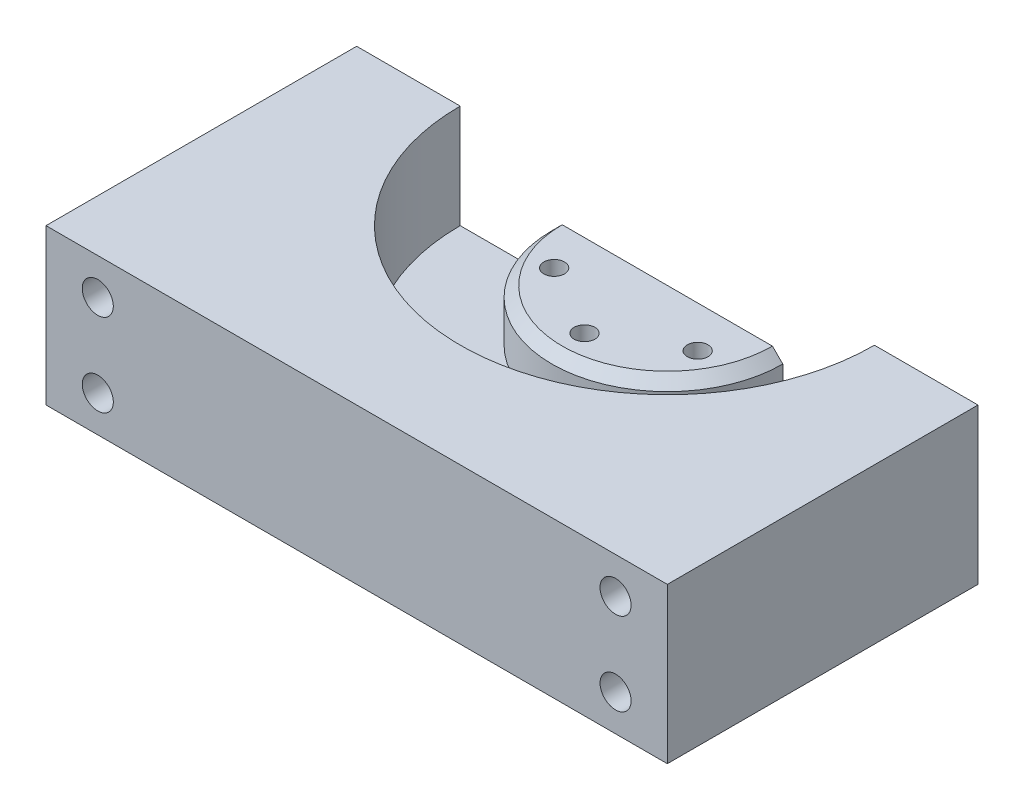
ISO-10303-21;
HEADER;
FILE_DESCRIPTION(('STEP AP214'),'2;1');
FILE_NAME('part.step','',(''),(''),'','','');
FILE_SCHEMA(('AUTOMOTIVE_DESIGN { 1 0 10303 214 1 1 1 1 }'));
ENDSEC;
DATA;
#1=APPLICATION_CONTEXT('core data for automotive mechanical design processes');
#2=APPLICATION_PROTOCOL_DEFINITION('international standard','automotive_design',2000,#1);
#3=PRODUCT_CONTEXT('',#1,'mechanical');
#4=PRODUCT('Part','Part','',(#3));
#5=PRODUCT_RELATED_PRODUCT_CATEGORY('part','',(#4));
#6=PRODUCT_DEFINITION_FORMATION('','',#4);
#7=PRODUCT_DEFINITION_CONTEXT('part definition',#1,'design');
#8=PRODUCT_DEFINITION('design','',#6,#7);
#9=PRODUCT_DEFINITION_SHAPE('','',#8);
#10=(LENGTH_UNIT() NAMED_UNIT(*) SI_UNIT(.MILLI.,.METRE.));
#11=(NAMED_UNIT(*) PLANE_ANGLE_UNIT() SI_UNIT($,.RADIAN.));
#12=(NAMED_UNIT(*) SI_UNIT($,.STERADIAN.) SOLID_ANGLE_UNIT());
#13=UNCERTAINTY_MEASURE_WITH_UNIT(LENGTH_MEASURE(1.E-05),#10,'distance_accuracy_value','');
#14=(GEOMETRIC_REPRESENTATION_CONTEXT(3) GLOBAL_UNCERTAINTY_ASSIGNED_CONTEXT((#13)) GLOBAL_UNIT_ASSIGNED_CONTEXT((#10,
#11,#12)) REPRESENTATION_CONTEXT('',''));
#15=CARTESIAN_POINT('',(0.,0.,0.));
#16=DIRECTION('',(0.,0.,1.));
#17=DIRECTION('',(1.,0.,0.));
#18=AXIS2_PLACEMENT_3D('',#15,#16,#17);
#19=CARTESIAN_POINT('',(0.,10.,0.));
#20=DIRECTION('',(0.,-1.,0.));
#21=DIRECTION('',(0.,0.,-1.));
#22=AXIS2_PLACEMENT_3D('',#19,#20,#21);
#23=PLANE('',#22);
#24=CARTESIAN_POINT('',(0.,10.,-30.));
#25=DIRECTION('',(0.,1.,0.));
#26=DIRECTION('',(0.,0.,1.));
#27=AXIS2_PLACEMENT_3D('',#24,#25,#26);
#28=CIRCLE('',#27,22.3);
#29=CARTESIAN_POINT('',(-22.3,10.,-30.));
#30=VERTEX_POINT('',#29);
#31=CARTESIAN_POINT('',(22.3,10.,-30.));
#32=VERTEX_POINT('',#31);
#33=EDGE_CURVE('E112',#30,#32,#28,.T.);
#34=ORIENTED_EDGE('',*,*,#33,.F.);
#35=DIRECTION('',(-1.,0.,0.));
#36=VECTOR('',#35,1.);
#37=CARTESIAN_POINT('',(-60.,10.,-30.));
#38=LINE('',#37,#36);
#39=CARTESIAN_POINT('',(-40.,10.,-30.));
#40=VERTEX_POINT('',#39);
#41=EDGE_CURVE('E118',#30,#40,#38,.T.);
#42=ORIENTED_EDGE('',*,*,#41,.T.);
#43=CARTESIAN_POINT('',(0.,10.,-30.));
#44=DIRECTION('',(0.,-1.,0.));
#45=DIRECTION('',(0.,0.,1.));
#46=AXIS2_PLACEMENT_3D('',#43,#44,#45);
#47=CIRCLE('',#46,40.);
#48=CARTESIAN_POINT('',(40.,10.,-30.));
#49=VERTEX_POINT('',#48);
#50=EDGE_CURVE('E138',#49,#40,#47,.T.);
#51=ORIENTED_EDGE('',*,*,#50,.F.);
#52=EDGE_CURVE('E124',#49,#32,#38,.T.);
#53=ORIENTED_EDGE('',*,*,#52,.T.);
#54=EDGE_LOOP('',(#34,#42,#51,#53));
#55=FACE_BOUND('',#54,.T.);
#56=ADVANCED_FACE('F41',(#55),#23,.F.);
#57=CARTESIAN_POINT('',(60.,10.,30.));
#58=DIRECTION('',(-1.,0.,0.));
#59=DIRECTION('',(0.,0.,1.));
#60=AXIS2_PLACEMENT_3D('',#57,#58,#59);
#61=PLANE('',#60);
#62=DIRECTION('',(0.,0.,-1.));
#63=VECTOR('',#62,1.);
#64=CARTESIAN_POINT('',(60.,0.,30.));
#65=LINE('',#64,#63);
#66=CARTESIAN_POINT('',(60.,0.,30.));
#67=VERTEX_POINT('',#66);
#68=CARTESIAN_POINT('',(60.,0.,-30.));
#69=VERTEX_POINT('',#68);
#70=EDGE_CURVE('E160',#67,#69,#65,.T.);
#71=ORIENTED_EDGE('',*,*,#70,.T.);
#72=DIRECTION('',(0.,-1.,0.));
#73=VECTOR('',#72,1.);
#74=CARTESIAN_POINT('',(60.,10.,-30.));
#75=LINE('',#74,#73);
#76=CARTESIAN_POINT('',(60.,30.,-30.));
#77=VERTEX_POINT('',#76);
#78=EDGE_CURVE('E178',#77,#69,#75,.T.);
#79=ORIENTED_EDGE('',*,*,#78,.F.);
#80=DIRECTION('',(0.,0.,-1.));
#81=VECTOR('',#80,1.);
#82=CARTESIAN_POINT('',(60.,30.,30.));
#83=LINE('',#82,#81);
#84=CARTESIAN_POINT('',(60.,30.,30.));
#85=VERTEX_POINT('',#84);
#86=EDGE_CURVE('E151',#85,#77,#83,.T.);
#87=ORIENTED_EDGE('',*,*,#86,.F.);
#88=DIRECTION('',(0.,-1.,0.));
#89=VECTOR('',#88,1.);
#90=CARTESIAN_POINT('',(60.,10.,30.));
#91=LINE('',#90,#89);
#92=EDGE_CURVE('E162',#85,#67,#91,.T.);
#93=ORIENTED_EDGE('',*,*,#92,.T.);
#94=EDGE_LOOP('',(#71,#79,#87,#93));
#95=FACE_BOUND('',#94,.T.);
#96=ADVANCED_FACE('F203',(#95),#61,.F.);
#97=CARTESIAN_POINT('',(-60.,10.,-30.));
#98=DIRECTION('',(0.,0.,1.));
#99=DIRECTION('',(1.,0.,0.));
#100=AXIS2_PLACEMENT_3D('',#97,#98,#99);
#101=PLANE('',#100);
#102=CARTESIAN_POINT('',(-50.,23.,-30.));
#103=DIRECTION('',(0.,0.,-1.));
#104=DIRECTION('',(-1.,0.,0.));
#105=AXIS2_PLACEMENT_3D('',#102,#103,#104);
#106=CIRCLE('',#105,3.);
#107=CARTESIAN_POINT('',(-53.,23.,-30.));
#108=VERTEX_POINT('',#107);
#109=EDGE_CURVE('E232',#108,#108,#106,.T.);
#110=ORIENTED_EDGE('',*,*,#109,.F.);
#111=EDGE_LOOP('',(#110));
#112=FACE_BOUND('',#111,.T.);
#113=CARTESIAN_POINT('',(50.,7.,-30.));
#114=DIRECTION('',(0.,0.,-1.));
#115=DIRECTION('',(-1.,0.,0.));
#116=AXIS2_PLACEMENT_3D('',#113,#114,#115);
#117=CIRCLE('',#116,3.);
#118=CARTESIAN_POINT('',(47.,7.,-30.));
#119=VERTEX_POINT('',#118);
#120=EDGE_CURVE('E236',#119,#119,#117,.T.);
#121=ORIENTED_EDGE('',*,*,#120,.F.);
#122=EDGE_LOOP('',(#121));
#123=FACE_BOUND('',#122,.T.);
#124=CARTESIAN_POINT('',(-50.,7.,-30.));
#125=DIRECTION('',(0.,0.,-1.));
#126=DIRECTION('',(-1.,0.,0.));
#127=AXIS2_PLACEMENT_3D('',#124,#125,#126);
#128=CIRCLE('',#127,3.);
#129=CARTESIAN_POINT('',(-53.,7.,-30.));
#130=VERTEX_POINT('',#129);
#131=EDGE_CURVE('E240',#130,#130,#128,.T.);
#132=ORIENTED_EDGE('',*,*,#131,.F.);
#133=EDGE_LOOP('',(#132));
#134=FACE_BOUND('',#133,.T.);
#135=CARTESIAN_POINT('',(50.,23.,-30.));
#136=DIRECTION('',(0.,0.,-1.));
#137=DIRECTION('',(-1.,0.,0.));
#138=AXIS2_PLACEMENT_3D('',#135,#136,#137);
#139=CIRCLE('',#138,3.);
#140=CARTESIAN_POINT('',(47.,23.,-30.));
#141=VERTEX_POINT('',#140);
#142=EDGE_CURVE('E134',#141,#141,#139,.T.);
#143=ORIENTED_EDGE('',*,*,#142,.F.);
#144=EDGE_LOOP('',(#143));
#145=FACE_BOUND('',#144,.T.);
#146=DIRECTION('',(-1.,0.,0.));
#147=VECTOR('',#146,1.);
#148=CARTESIAN_POINT('',(-22.3,20.,-30.));
#149=LINE('',#148,#147);
#150=CARTESIAN_POINT('',(20.3,20.,-30.));
#151=VERTEX_POINT('',#150);
#152=CARTESIAN_POINT('',(-20.3,20.,-30.));
#153=VERTEX_POINT('',#152);
#154=EDGE_CURVE('E115',#151,#153,#149,.T.);
#155=ORIENTED_EDGE('',*,*,#154,.F.);
#156=DIRECTION('',(-0.707106781186546,0.707106781186549,0.));
#157=VECTOR('',#156,1.);
#158=CARTESIAN_POINT('',(0.,40.3000000000001,-30.));
#159=LINE('',#158,#157);
#160=CARTESIAN_POINT('',(22.3,18.,-30.));
#161=VERTEX_POINT('',#160);
#162=EDGE_CURVE('E50',#151,#161,#159,.F.);
#163=ORIENTED_EDGE('',*,*,#162,.T.);
#164=DIRECTION('',(0.,-1.,0.));
#165=VECTOR('',#164,1.);
#166=CARTESIAN_POINT('',(22.3,20.,-30.));
#167=LINE('',#166,#165);
#168=EDGE_CURVE('E114',#161,#32,#167,.T.);
#169=ORIENTED_EDGE('',*,*,#168,.T.);
#170=ORIENTED_EDGE('',*,*,#52,.F.);
#171=DIRECTION('',(0.,-1.,0.));
#172=VECTOR('',#171,1.);
#173=CARTESIAN_POINT('',(40.,30.,-30.));
#174=LINE('',#173,#172);
#175=CARTESIAN_POINT('',(40.,30.,-30.));
#176=VERTEX_POINT('',#175);
#177=EDGE_CURVE('E156',#176,#49,#174,.T.);
#178=ORIENTED_EDGE('',*,*,#177,.F.);
#179=DIRECTION('',(-1.,0.,0.));
#180=VECTOR('',#179,1.);
#181=CARTESIAN_POINT('',(60.,30.,-30.));
#182=LINE('',#181,#180);
#183=EDGE_CURVE('E154',#77,#176,#182,.T.);
#184=ORIENTED_EDGE('',*,*,#183,.F.);
#185=ORIENTED_EDGE('',*,*,#78,.T.);
#186=DIRECTION('',(-1.,0.,0.));
#187=VECTOR('',#186,1.);
#188=CARTESIAN_POINT('',(-60.,0.,-30.));
#189=LINE('',#188,#187);
#190=CARTESIAN_POINT('',(-60.,0.,-30.));
#191=VERTEX_POINT('',#190);
#192=EDGE_CURVE('E165',#69,#191,#189,.T.);
#193=ORIENTED_EDGE('',*,*,#192,.T.);
#194=DIRECTION('',(0.,-1.,0.));
#195=VECTOR('',#194,1.);
#196=CARTESIAN_POINT('',(-60.,10.,-30.));
#197=LINE('',#196,#195);
#198=CARTESIAN_POINT('',(-60.,30.,-30.));
#199=VERTEX_POINT('',#198);
#200=EDGE_CURVE('E175',#199,#191,#197,.T.);
#201=ORIENTED_EDGE('',*,*,#200,.F.);
#202=DIRECTION('',(-1.,0.,0.));
#203=VECTOR('',#202,1.);
#204=CARTESIAN_POINT('',(-40.,30.,-30.));
#205=LINE('',#204,#203);
#206=CARTESIAN_POINT('',(-40.,30.,-30.));
#207=VERTEX_POINT('',#206);
#208=EDGE_CURVE('E142',#207,#199,#205,.T.);
#209=ORIENTED_EDGE('',*,*,#208,.F.);
#210=DIRECTION('',(0.,-1.,0.));
#211=VECTOR('',#210,1.);
#212=CARTESIAN_POINT('',(-40.,30.,-30.));
#213=LINE('',#212,#211);
#214=EDGE_CURVE('E121',#207,#40,#213,.T.);
#215=ORIENTED_EDGE('',*,*,#214,.T.);
#216=ORIENTED_EDGE('',*,*,#41,.F.);
#217=DIRECTION('',(0.,-1.,0.));
#218=VECTOR('',#217,1.);
#219=CARTESIAN_POINT('',(-22.3,20.,-30.));
#220=LINE('',#219,#218);
#221=CARTESIAN_POINT('',(-22.3,18.,-30.));
#222=VERTEX_POINT('',#221);
#223=EDGE_CURVE('E108',#222,#30,#220,.T.);
#224=ORIENTED_EDGE('',*,*,#223,.F.);
#225=DIRECTION('',(-0.707106781186546,-0.707106781186549,0.));
#226=VECTOR('',#225,1.);
#227=CARTESIAN_POINT('',(0.,40.3000000000001,-30.));
#228=LINE('',#227,#226);
#229=EDGE_CURVE('E184',#222,#153,#228,.F.);
#230=ORIENTED_EDGE('',*,*,#229,.T.);
#231=EDGE_LOOP('',(#155,#163,#169,#170,#178,#184,#185,#193,#201,#209,#215,#216,#224,#230));
#232=FACE_BOUND('',#231,.T.);
#233=ADVANCED_FACE('F119',(#112,#123,#134,#145,#232),#101,.F.);
#234=CARTESIAN_POINT('',(-60.,10.,30.));
#235=DIRECTION('',(1.,0.,0.));
#236=DIRECTION('',(0.,0.,-1.));
#237=AXIS2_PLACEMENT_3D('',#234,#235,#236);
#238=PLANE('',#237);
#239=DIRECTION('',(0.,0.,1.));
#240=VECTOR('',#239,1.);
#241=CARTESIAN_POINT('',(-60.,0.,30.));
#242=LINE('',#241,#240);
#243=CARTESIAN_POINT('',(-60.,0.,30.));
#244=VERTEX_POINT('',#243);
#245=EDGE_CURVE('E167',#191,#244,#242,.T.);
#246=ORIENTED_EDGE('',*,*,#245,.T.);
#247=DIRECTION('',(0.,-1.,0.));
#248=VECTOR('',#247,1.);
#249=CARTESIAN_POINT('',(-60.,10.,30.));
#250=LINE('',#249,#248);
#251=CARTESIAN_POINT('',(-60.,30.,30.));
#252=VERTEX_POINT('',#251);
#253=EDGE_CURVE('E172',#252,#244,#250,.T.);
#254=ORIENTED_EDGE('',*,*,#253,.F.);
#255=DIRECTION('',(0.,0.,1.));
#256=VECTOR('',#255,1.);
#257=CARTESIAN_POINT('',(-60.,30.,-30.));
#258=LINE('',#257,#256);
#259=EDGE_CURVE('E145',#199,#252,#258,.T.);
#260=ORIENTED_EDGE('',*,*,#259,.F.);
#261=ORIENTED_EDGE('',*,*,#200,.T.);
#262=EDGE_LOOP('',(#246,#254,#260,#261));
#263=FACE_BOUND('',#262,.T.);
#264=ADVANCED_FACE('F221',(#263),#238,.F.);
#265=CARTESIAN_POINT('',(-60.,10.,30.));
#266=DIRECTION('',(0.,0.,-1.));
#267=DIRECTION('',(-1.,0.,0.));
#268=AXIS2_PLACEMENT_3D('',#265,#266,#267);
#269=PLANE('',#268);
#270=CARTESIAN_POINT('',(-50.,23.,30.));
#271=DIRECTION('',(0.,0.,-1.));
#272=DIRECTION('',(-1.,0.,0.));
#273=AXIS2_PLACEMENT_3D('',#270,#271,#272);
#274=CIRCLE('',#273,3.);
#275=CARTESIAN_POINT('',(-53.,23.,30.));
#276=VERTEX_POINT('',#275);
#277=EDGE_CURVE('E244',#276,#276,#274,.F.);
#278=ORIENTED_EDGE('',*,*,#277,.F.);
#279=EDGE_LOOP('',(#278));
#280=FACE_BOUND('',#279,.T.);
#281=CARTESIAN_POINT('',(50.,7.,30.));
#282=DIRECTION('',(0.,0.,-1.));
#283=DIRECTION('',(-1.,0.,0.));
#284=AXIS2_PLACEMENT_3D('',#281,#282,#283);
#285=CIRCLE('',#284,3.);
#286=CARTESIAN_POINT('',(47.,7.,30.));
#287=VERTEX_POINT('',#286);
#288=EDGE_CURVE('E248',#287,#287,#285,.F.);
#289=ORIENTED_EDGE('',*,*,#288,.F.);
#290=EDGE_LOOP('',(#289));
#291=FACE_BOUND('',#290,.T.);
#292=CARTESIAN_POINT('',(-50.,7.,30.));
#293=DIRECTION('',(0.,0.,-1.));
#294=DIRECTION('',(-1.,0.,0.));
#295=AXIS2_PLACEMENT_3D('',#292,#293,#294);
#296=CIRCLE('',#295,3.);
#297=CARTESIAN_POINT('',(-53.,7.,30.));
#298=VERTEX_POINT('',#297);
#299=EDGE_CURVE('E254',#298,#298,#296,.F.);
#300=ORIENTED_EDGE('',*,*,#299,.F.);
#301=EDGE_LOOP('',(#300));
#302=FACE_BOUND('',#301,.T.);
#303=CARTESIAN_POINT('',(50.,23.,30.));
#304=DIRECTION('',(0.,0.,-1.));
#305=DIRECTION('',(-1.,0.,0.));
#306=AXIS2_PLACEMENT_3D('',#303,#304,#305);
#307=CIRCLE('',#306,3.);
#308=CARTESIAN_POINT('',(47.,23.,30.));
#309=VERTEX_POINT('',#308);
#310=EDGE_CURVE('E129',#309,#309,#307,.F.);
#311=ORIENTED_EDGE('',*,*,#310,.F.);
#312=EDGE_LOOP('',(#311));
#313=FACE_BOUND('',#312,.T.);
#314=DIRECTION('',(1.,0.,0.));
#315=VECTOR('',#314,1.);
#316=CARTESIAN_POINT('',(-60.,0.,30.));
#317=LINE('',#316,#315);
#318=EDGE_CURVE('E125',#244,#67,#317,.T.);
#319=ORIENTED_EDGE('',*,*,#318,.T.);
#320=ORIENTED_EDGE('',*,*,#92,.F.);
#321=DIRECTION('',(1.,0.,0.));
#322=VECTOR('',#321,1.);
#323=CARTESIAN_POINT('',(-60.,30.,30.));
#324=LINE('',#323,#322);
#325=EDGE_CURVE('E148',#252,#85,#324,.T.);
#326=ORIENTED_EDGE('',*,*,#325,.F.);
#327=ORIENTED_EDGE('',*,*,#253,.T.);
#328=EDGE_LOOP('',(#319,#320,#326,#327));
#329=FACE_BOUND('',#328,.T.);
#330=ADVANCED_FACE('F217',(#280,#291,#302,#313,#329),#269,.F.);
#331=CARTESIAN_POINT('',(0.,0.,0.));
#332=DIRECTION('',(0.,-1.,0.));
#333=DIRECTION('',(0.,0.,-1.));
#334=AXIS2_PLACEMENT_3D('',#331,#332,#333);
#335=PLANE('',#334);
#336=CARTESIAN_POINT('',(0.,0.,-14.));
#337=DIRECTION('',(0.,-1.,0.));
#338=DIRECTION('',(0.,0.,-1.));
#339=AXIS2_PLACEMENT_3D('',#336,#337,#338);
#340=CIRCLE('',#339,2.);
#341=CARTESIAN_POINT('',(0.,0.,-16.));
#342=VERTEX_POINT('',#341);
#343=EDGE_CURVE('E270',#342,#342,#340,.F.);
#344=ORIENTED_EDGE('',*,*,#343,.T.);
#345=EDGE_LOOP('',(#344));
#346=FACE_BOUND('',#345,.T.);
#347=CARTESIAN_POINT('',(-13.856406460551,0.,-21.9999999999999));
#348=DIRECTION('',(0.,-1.,0.));
#349=DIRECTION('',(0.,0.,-1.));
#350=AXIS2_PLACEMENT_3D('',#347,#348,#349);
#351=CIRCLE('',#350,2.);
#352=CARTESIAN_POINT('',(-13.856406460551,0.,-23.9999999999999));
#353=VERTEX_POINT('',#352);
#354=EDGE_CURVE('E267',#353,#353,#351,.F.);
#355=ORIENTED_EDGE('',*,*,#354,.T.);
#356=EDGE_LOOP('',(#355));
#357=FACE_BOUND('',#356,.T.);
#358=CARTESIAN_POINT('',(13.856406460551,0.,-21.9999999999999));
#359=DIRECTION('',(0.,-1.,0.));
#360=DIRECTION('',(0.,0.,-1.));
#361=AXIS2_PLACEMENT_3D('',#358,#359,#360);
#362=CIRCLE('',#361,2.);
#363=CARTESIAN_POINT('',(13.856406460551,0.,-23.9999999999999));
#364=VERTEX_POINT('',#363);
#365=EDGE_CURVE('E261',#364,#364,#362,.F.);
#366=ORIENTED_EDGE('',*,*,#365,.T.);
#367=EDGE_LOOP('',(#366));
#368=FACE_BOUND('',#367,.T.);
#369=ORIENTED_EDGE('',*,*,#70,.F.);
#370=ORIENTED_EDGE('',*,*,#318,.F.);
#371=ORIENTED_EDGE('',*,*,#245,.F.);
#372=ORIENTED_EDGE('',*,*,#192,.F.);
#373=EDGE_LOOP('',(#369,#370,#371,#372));
#374=FACE_BOUND('',#373,.T.);
#375=ADVANCED_FACE('F214',(#346,#357,#368,#374),#335,.T.);
#376=CARTESIAN_POINT('',(0.,30.,-30.));
#377=DIRECTION('',(0.,-1.,0.));
#378=DIRECTION('',(0.,0.,-1.));
#379=AXIS2_PLACEMENT_3D('',#376,#377,#378);
#380=CYLINDRICAL_SURFACE('',#379,40.);
#381=ORIENTED_EDGE('',*,*,#50,.T.);
#382=ORIENTED_EDGE('',*,*,#214,.F.);
#383=CARTESIAN_POINT('',(0.,30.,-30.));
#384=DIRECTION('',(0.,-1.,0.));
#385=DIRECTION('',(0.,0.,1.));
#386=AXIS2_PLACEMENT_3D('',#383,#384,#385);
#387=CIRCLE('',#386,40.);
#388=EDGE_CURVE('E139',#176,#207,#387,.T.);
#389=ORIENTED_EDGE('',*,*,#388,.F.);
#390=ORIENTED_EDGE('',*,*,#177,.T.);
#391=EDGE_LOOP('',(#381,#382,#389,#390));
#392=FACE_BOUND('',#391,.T.);
#393=ADVANCED_FACE('F212',(#392),#380,.F.);
#394=CARTESIAN_POINT('',(0.,30.,-30.));
#395=DIRECTION('',(0.,1.,0.));
#396=DIRECTION('',(0.,0.,1.));
#397=AXIS2_PLACEMENT_3D('',#394,#395,#396);
#398=PLANE('',#397);
#399=ORIENTED_EDGE('',*,*,#388,.T.);
#400=ORIENTED_EDGE('',*,*,#208,.T.);
#401=ORIENTED_EDGE('',*,*,#259,.T.);
#402=ORIENTED_EDGE('',*,*,#325,.T.);
#403=ORIENTED_EDGE('',*,*,#86,.T.);
#404=ORIENTED_EDGE('',*,*,#183,.T.);
#405=EDGE_LOOP('',(#399,#400,#401,#402,#403,#404));
#406=FACE_BOUND('',#405,.T.);
#407=ADVANCED_FACE('F306',(#406),#398,.T.);
#408=CARTESIAN_POINT('',(0.,20.,-30.));
#409=DIRECTION('',(0.,-1.,0.));
#410=DIRECTION('',(0.,0.,-1.));
#411=AXIS2_PLACEMENT_3D('',#408,#409,#410);
#412=CYLINDRICAL_SURFACE('',#411,22.3);
#413=ORIENTED_EDGE('',*,*,#168,.F.);
#414=CARTESIAN_POINT('',(0.,18.,-30.));
#415=DIRECTION('',(0.,1.,0.));
#416=DIRECTION('',(0.,0.,1.));
#417=AXIS2_PLACEMENT_3D('',#414,#415,#416);
#418=CIRCLE('',#417,22.3);
#419=EDGE_CURVE('E11',#161,#222,#418,.F.);
#420=ORIENTED_EDGE('',*,*,#419,.T.);
#421=ORIENTED_EDGE('',*,*,#223,.T.);
#422=ORIENTED_EDGE('',*,*,#33,.T.);
#423=EDGE_LOOP('',(#413,#420,#421,#422));
#424=FACE_BOUND('',#423,.T.);
#425=ADVANCED_FACE('F110',(#424),#412,.T.);
#426=CARTESIAN_POINT('',(0.,20.,-30.));
#427=DIRECTION('',(0.,1.,0.));
#428=DIRECTION('',(0.,0.,1.));
#429=AXIS2_PLACEMENT_3D('',#426,#427,#428);
#430=PLANE('',#429);
#431=CARTESIAN_POINT('',(0.,20.,-14.));
#432=DIRECTION('',(0.,1.,0.));
#433=DIRECTION('',(0.,0.,1.));
#434=AXIS2_PLACEMENT_3D('',#431,#432,#433);
#435=CIRCLE('',#434,2.);
#436=CARTESIAN_POINT('',(0.,20.,-12.));
#437=VERTEX_POINT('',#436);
#438=EDGE_CURVE('E257',#437,#437,#435,.T.);
#439=ORIENTED_EDGE('',*,*,#438,.F.);
#440=EDGE_LOOP('',(#439));
#441=FACE_BOUND('',#440,.T.);
#442=CARTESIAN_POINT('',(-13.856406460551,20.,-21.9999999999999));
#443=DIRECTION('',(0.,1.,0.));
#444=DIRECTION('',(0.,0.,1.));
#445=AXIS2_PLACEMENT_3D('',#442,#443,#444);
#446=CIRCLE('',#445,2.);
#447=CARTESIAN_POINT('',(-13.856406460551,20.,-19.9999999999999));
#448=VERTEX_POINT('',#447);
#449=EDGE_CURVE('E264',#448,#448,#446,.T.);
#450=ORIENTED_EDGE('',*,*,#449,.F.);
#451=EDGE_LOOP('',(#450));
#452=FACE_BOUND('',#451,.T.);
#453=CARTESIAN_POINT('',(13.856406460551,20.,-21.9999999999999));
#454=DIRECTION('',(0.,1.,0.));
#455=DIRECTION('',(0.,0.,1.));
#456=AXIS2_PLACEMENT_3D('',#453,#454,#455);
#457=CIRCLE('',#456,2.);
#458=CARTESIAN_POINT('',(13.856406460551,20.,-19.9999999999999));
#459=VERTEX_POINT('',#458);
#460=EDGE_CURVE('E258',#459,#459,#457,.T.);
#461=ORIENTED_EDGE('',*,*,#460,.F.);
#462=EDGE_LOOP('',(#461));
#463=FACE_BOUND('',#462,.T.);
#464=ORIENTED_EDGE('',*,*,#154,.T.);
#465=CARTESIAN_POINT('',(0.,20.,-30.));
#466=DIRECTION('',(0.,1.,0.));
#467=DIRECTION('',(0.,0.,1.));
#468=AXIS2_PLACEMENT_3D('',#465,#466,#467);
#469=CIRCLE('',#468,20.3);
#470=EDGE_CURVE('E181',#153,#151,#469,.T.);
#471=ORIENTED_EDGE('',*,*,#470,.T.);
#472=EDGE_LOOP('',(#464,#471));
#473=FACE_BOUND('',#472,.T.);
#474=ADVANCED_FACE('F188',(#441,#452,#463,#473),#430,.T.);
#475=CARTESIAN_POINT('',(0.,20.,-30.));
#476=DIRECTION('',(0.,-1.,0.));
#477=DIRECTION('',(0.,0.,-1.));
#478=AXIS2_PLACEMENT_3D('',#475,#476,#477);
#479=CONICAL_SURFACE('',#478,20.3,0.785398163397447);
#480=ORIENTED_EDGE('',*,*,#229,.F.);
#481=ORIENTED_EDGE('',*,*,#419,.F.);
#482=ORIENTED_EDGE('',*,*,#162,.F.);
#483=ORIENTED_EDGE('',*,*,#470,.F.);
#484=EDGE_LOOP('',(#480,#481,#482,#483));
#485=FACE_BOUND('',#484,.T.);
#486=ADVANCED_FACE('F44',(#485),#479,.T.);
#487=CARTESIAN_POINT('',(50.,23.,30.001));
#488=DIRECTION('',(0.,0.,-1.));
#489=DIRECTION('',(-1.,0.,0.));
#490=AXIS2_PLACEMENT_3D('',#487,#488,#489);
#491=CYLINDRICAL_SURFACE('',#490,3.);
#492=ORIENTED_EDGE('',*,*,#142,.T.);
#493=EDGE_LOOP('',(#492));
#494=FACE_BOUND('',#493,.T.);
#495=ORIENTED_EDGE('',*,*,#310,.T.);
#496=EDGE_LOOP('',(#495));
#497=FACE_BOUND('',#496,.T.);
#498=ADVANCED_FACE('F190',(#494,#497),#491,.F.);
#499=CARTESIAN_POINT('',(-50.,7.,30.001));
#500=DIRECTION('',(0.,0.,-1.));
#501=DIRECTION('',(-1.,0.,0.));
#502=AXIS2_PLACEMENT_3D('',#499,#500,#501);
#503=CYLINDRICAL_SURFACE('',#502,3.);
#504=ORIENTED_EDGE('',*,*,#131,.T.);
#505=EDGE_LOOP('',(#504));
#506=FACE_BOUND('',#505,.T.);
#507=ORIENTED_EDGE('',*,*,#299,.T.);
#508=EDGE_LOOP('',(#507));
#509=FACE_BOUND('',#508,.T.);
#510=ADVANCED_FACE('F196',(#506,#509),#503,.F.);
#511=CARTESIAN_POINT('',(50.,7.,30.001));
#512=DIRECTION('',(0.,0.,-1.));
#513=DIRECTION('',(-1.,0.,0.));
#514=AXIS2_PLACEMENT_3D('',#511,#512,#513);
#515=CYLINDRICAL_SURFACE('',#514,3.);
#516=ORIENTED_EDGE('',*,*,#120,.T.);
#517=EDGE_LOOP('',(#516));
#518=FACE_BOUND('',#517,.T.);
#519=ORIENTED_EDGE('',*,*,#288,.T.);
#520=EDGE_LOOP('',(#519));
#521=FACE_BOUND('',#520,.T.);
#522=ADVANCED_FACE('F294',(#518,#521),#515,.F.);
#523=CARTESIAN_POINT('',(-50.,23.,30.001));
#524=DIRECTION('',(0.,0.,-1.));
#525=DIRECTION('',(-1.,0.,0.));
#526=AXIS2_PLACEMENT_3D('',#523,#524,#525);
#527=CYLINDRICAL_SURFACE('',#526,3.);
#528=ORIENTED_EDGE('',*,*,#109,.T.);
#529=EDGE_LOOP('',(#528));
#530=FACE_BOUND('',#529,.T.);
#531=ORIENTED_EDGE('',*,*,#277,.T.);
#532=EDGE_LOOP('',(#531));
#533=FACE_BOUND('',#532,.T.);
#534=ADVANCED_FACE('F285',(#530,#533),#527,.F.);
#535=CARTESIAN_POINT('',(13.856406460551,-0.001000000000001,-21.9999999999999));
#536=DIRECTION('',(0.,1.,0.));
#537=DIRECTION('',(0.,0.,1.));
#538=AXIS2_PLACEMENT_3D('',#535,#536,#537);
#539=CYLINDRICAL_SURFACE('',#538,2.);
#540=ORIENTED_EDGE('',*,*,#365,.F.);
#541=EDGE_LOOP('',(#540));
#542=FACE_BOUND('',#541,.T.);
#543=ORIENTED_EDGE('',*,*,#460,.T.);
#544=EDGE_LOOP('',(#543));
#545=FACE_BOUND('',#544,.T.);
#546=ADVANCED_FACE('F282',(#542,#545),#539,.F.);
#547=CARTESIAN_POINT('',(-13.856406460551,-0.001000000000001,-21.9999999999999));
#548=DIRECTION('',(0.,1.,0.));
#549=DIRECTION('',(0.,0.,1.));
#550=AXIS2_PLACEMENT_3D('',#547,#548,#549);
#551=CYLINDRICAL_SURFACE('',#550,2.);
#552=ORIENTED_EDGE('',*,*,#354,.F.);
#553=EDGE_LOOP('',(#552));
#554=FACE_BOUND('',#553,.T.);
#555=ORIENTED_EDGE('',*,*,#449,.T.);
#556=EDGE_LOOP('',(#555));
#557=FACE_BOUND('',#556,.T.);
#558=ADVANCED_FACE('F284',(#554,#557),#551,.F.);
#559=CARTESIAN_POINT('',(0.,-0.001000000000001,-14.));
#560=DIRECTION('',(0.,1.,0.));
#561=DIRECTION('',(0.,0.,1.));
#562=AXIS2_PLACEMENT_3D('',#559,#560,#561);
#563=CYLINDRICAL_SURFACE('',#562,2.);
#564=ORIENTED_EDGE('',*,*,#343,.F.);
#565=EDGE_LOOP('',(#564));
#566=FACE_BOUND('',#565,.T.);
#567=ORIENTED_EDGE('',*,*,#438,.T.);
#568=EDGE_LOOP('',(#567));
#569=FACE_BOUND('',#568,.T.);
#570=ADVANCED_FACE('F276',(#566,#569),#563,.F.);
#571=CLOSED_SHELL('',(#56,#96,#233,#264,#330,#375,#393,#407,#425,#474,#486,#498,#510,#522,#534,
#546,#558,#570));
#572=MANIFOLD_SOLID_BREP('B2',#571);
#573=ADVANCED_BREP_SHAPE_REPRESENTATION('',(#18,#572),#14);
#574=SHAPE_DEFINITION_REPRESENTATION(#9,#573);
ENDSEC;
END-ISO-10303-21;
